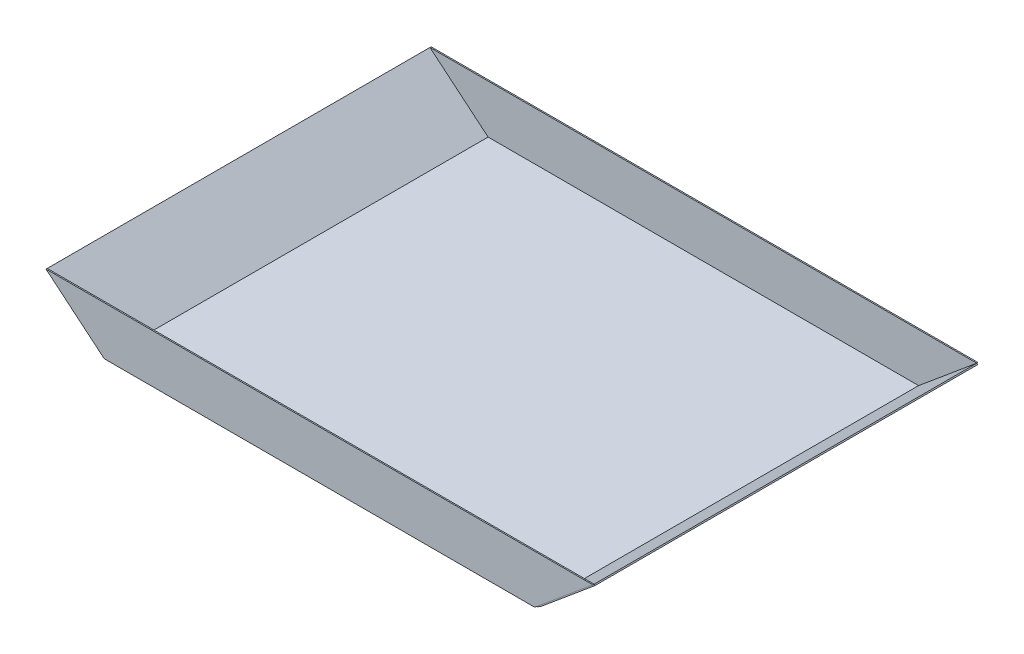
ISO-10303-21;
HEADER;
FILE_DESCRIPTION(('STEP AP214'),'2;1');
FILE_NAME('part.step','',(''),(''),'','','');
FILE_SCHEMA(('AUTOMOTIVE_DESIGN { 1 0 10303 214 1 1 1 1 }'));
ENDSEC;
DATA;
#1=APPLICATION_CONTEXT('core data for automotive mechanical design processes');
#2=APPLICATION_PROTOCOL_DEFINITION('international standard','automotive_design',2000,#1);
#3=PRODUCT_CONTEXT('',#1,'mechanical');
#4=PRODUCT('Part','Part','',(#3));
#5=PRODUCT_RELATED_PRODUCT_CATEGORY('part','',(#4));
#6=PRODUCT_DEFINITION_FORMATION('','',#4);
#7=PRODUCT_DEFINITION_CONTEXT('part definition',#1,'design');
#8=PRODUCT_DEFINITION('design','',#6,#7);
#9=PRODUCT_DEFINITION_SHAPE('','',#8);
#10=(LENGTH_UNIT() NAMED_UNIT(*) SI_UNIT(.MILLI.,.METRE.));
#11=(NAMED_UNIT(*) PLANE_ANGLE_UNIT() SI_UNIT($,.RADIAN.));
#12=(NAMED_UNIT(*) SI_UNIT($,.STERADIAN.) SOLID_ANGLE_UNIT());
#13=UNCERTAINTY_MEASURE_WITH_UNIT(LENGTH_MEASURE(1.E-05),#10,'distance_accuracy_value','');
#14=(GEOMETRIC_REPRESENTATION_CONTEXT(3) GLOBAL_UNCERTAINTY_ASSIGNED_CONTEXT((#13)) GLOBAL_UNIT_ASSIGNED_CONTEXT((#10,
#11,#12)) REPRESENTATION_CONTEXT('',''));
#15=CARTESIAN_POINT('',(0.,0.,0.));
#16=DIRECTION('',(0.,0.,1.));
#17=DIRECTION('',(1.,0.,0.));
#18=AXIS2_PLACEMENT_3D('',#15,#16,#17);
#19=CARTESIAN_POINT('',(564.261,0.,-1.5875));
#20=DIRECTION('',(-0.640243780505603,0.768171791674162,0.));
#21=DIRECTION('',(-0.768171791674162,-0.640243780505603,0.));
#22=AXIS2_PLACEMENT_3D('',#19,#20,#21);
#23=PLANE('',#22);
#24=DIRECTION('',(-0.768171791674163,-0.640243780505603,0.));
#25=VECTOR('',#24,1.);
#26=CARTESIAN_POINT('',(564.261,0.,0.));
#27=LINE('',#26,#25);
#28=CARTESIAN_POINT('',(640.551213318328,63.5851708171335,0.));
#29=VERTEX_POINT('',#28);
#30=CARTESIAN_POINT('',(564.261,0.,0.));
#31=VERTEX_POINT('',#30);
#32=EDGE_CURVE('E107',#29,#31,#27,.T.);
#33=ORIENTED_EDGE('',*,*,#32,.T.);
#34=DIRECTION('',(0.,0.,1.));
#35=VECTOR('',#34,1.);
#36=CARTESIAN_POINT('',(564.261,0.,-1.5875));
#37=LINE('',#36,#35);
#38=CARTESIAN_POINT('',(564.261,0.,-1.5875));
#39=VERTEX_POINT('',#38);
#40=EDGE_CURVE('E12',#39,#31,#37,.T.);
#41=ORIENTED_EDGE('',*,*,#40,.F.);
#42=DIRECTION('',(-0.768171791674163,-0.640243780505603,0.));
#43=VECTOR('',#42,1.);
#44=CARTESIAN_POINT('',(564.261,0.,-1.5875));
#45=LINE('',#44,#43);
#46=CARTESIAN_POINT('',(640.551213318328,63.5851708171335,-1.5875));
#47=VERTEX_POINT('',#46);
#48=EDGE_CURVE('E95',#47,#39,#45,.T.);
#49=ORIENTED_EDGE('',*,*,#48,.F.);
#50=DIRECTION('',(0.,0.,1.));
#51=VECTOR('',#50,1.);
#52=CARTESIAN_POINT('',(640.551213318328,63.5851708171335,-1.5875));
#53=LINE('',#52,#51);
#54=EDGE_CURVE('E103',#47,#29,#53,.T.);
#55=ORIENTED_EDGE('',*,*,#54,.T.);
#56=EDGE_LOOP('',(#33,#41,#49,#55));
#57=FACE_BOUND('',#56,.T.);
#58=ADVANCED_FACE('F44',(#57),#23,.F.);
#59=CARTESIAN_POINT('',(0.,0.,-1.5875));
#60=DIRECTION('',(0.,1.,0.));
#61=DIRECTION('',(0.,0.,1.));
#62=AXIS2_PLACEMENT_3D('',#59,#60,#61);
#63=PLANE('',#62);
#64=DIRECTION('',(-1.,0.,0.));
#65=VECTOR('',#64,1.);
#66=CARTESIAN_POINT('',(0.,0.,0.));
#67=LINE('',#66,#65);
#68=CARTESIAN_POINT('',(0.,0.,0.));
#69=VERTEX_POINT('',#68);
#70=EDGE_CURVE('E99',#31,#69,#67,.T.);
#71=ORIENTED_EDGE('',*,*,#70,.T.);
#72=DIRECTION('',(0.,0.,1.));
#73=VECTOR('',#72,1.);
#74=CARTESIAN_POINT('',(0.,0.,-1.5875));
#75=LINE('',#74,#73);
#76=CARTESIAN_POINT('',(0.,0.,-1.5875));
#77=VERTEX_POINT('',#76);
#78=EDGE_CURVE('E52',#77,#69,#75,.T.);
#79=ORIENTED_EDGE('',*,*,#78,.F.);
#80=DIRECTION('',(-1.,0.,0.));
#81=VECTOR('',#80,1.);
#82=CARTESIAN_POINT('',(0.,0.,-1.5875));
#83=LINE('',#82,#81);
#84=EDGE_CURVE('E90',#39,#77,#83,.T.);
#85=ORIENTED_EDGE('',*,*,#84,.F.);
#86=ORIENTED_EDGE('',*,*,#40,.T.);
#87=EDGE_LOOP('',(#71,#79,#85,#86));
#88=FACE_BOUND('',#87,.T.);
#89=ADVANCED_FACE('F98',(#88),#63,.F.);
#90=CARTESIAN_POINT('',(-76.2902133183278,63.5851708171335,-1.5875));
#91=DIRECTION('',(0.640243780505603,0.768171791674163,0.));
#92=DIRECTION('',(-0.768171791674163,0.640243780505603,0.));
#93=AXIS2_PLACEMENT_3D('',#90,#91,#92);
#94=PLANE('',#93);
#95=DIRECTION('',(-0.768171791674163,0.640243780505603,0.));
#96=VECTOR('',#95,1.);
#97=CARTESIAN_POINT('',(-76.2902133183278,63.5851708171335,0.));
#98=LINE('',#97,#96);
#99=CARTESIAN_POINT('',(-76.2902133183278,63.5851708171335,0.));
#100=VERTEX_POINT('',#99);
#101=EDGE_CURVE('E77',#69,#100,#98,.T.);
#102=ORIENTED_EDGE('',*,*,#101,.T.);
#103=DIRECTION('',(0.,0.,1.));
#104=VECTOR('',#103,1.);
#105=CARTESIAN_POINT('',(-76.2902133183278,63.5851708171335,-1.5875));
#106=LINE('',#105,#104);
#107=CARTESIAN_POINT('',(-76.2902133183278,63.5851708171335,-1.5875));
#108=VERTEX_POINT('',#107);
#109=EDGE_CURVE('E100',#108,#100,#106,.T.);
#110=ORIENTED_EDGE('',*,*,#109,.F.);
#111=DIRECTION('',(-0.768171791674163,0.640243780505603,0.));
#112=VECTOR('',#111,1.);
#113=CARTESIAN_POINT('',(-76.2902133183278,63.5851708171335,-1.5875));
#114=LINE('',#113,#112);
#115=EDGE_CURVE('E93',#77,#108,#114,.T.);
#116=ORIENTED_EDGE('',*,*,#115,.F.);
#117=ORIENTED_EDGE('',*,*,#78,.T.);
#118=EDGE_LOOP('',(#102,#110,#116,#117));
#119=FACE_BOUND('',#118,.T.);
#120=ADVANCED_FACE('F101',(#119),#94,.F.);
#121=CARTESIAN_POINT('',(640.551213318328,63.5851708171335,-1.5875));
#122=DIRECTION('',(0.,-1.,0.));
#123=DIRECTION('',(1.,0.,0.));
#124=AXIS2_PLACEMENT_3D('',#121,#122,#123);
#125=PLANE('',#124);
#126=DIRECTION('',(1.,0.,0.));
#127=VECTOR('',#126,1.);
#128=CARTESIAN_POINT('',(640.551213318328,63.5851708171335,0.));
#129=LINE('',#128,#127);
#130=EDGE_CURVE('E83',#100,#29,#129,.T.);
#131=ORIENTED_EDGE('',*,*,#130,.T.);
#132=ORIENTED_EDGE('',*,*,#54,.F.);
#133=DIRECTION('',(1.,0.,0.));
#134=VECTOR('',#133,1.);
#135=CARTESIAN_POINT('',(640.551213318328,63.5851708171335,-1.5875));
#136=LINE('',#135,#134);
#137=EDGE_CURVE('E60',#108,#47,#136,.T.);
#138=ORIENTED_EDGE('',*,*,#137,.F.);
#139=ORIENTED_EDGE('',*,*,#109,.T.);
#140=EDGE_LOOP('',(#131,#132,#138,#139));
#141=FACE_BOUND('',#140,.T.);
#142=ADVANCED_FACE('F114',(#141),#125,.F.);
#143=CARTESIAN_POINT('',(0.,0.,-1.5875));
#144=DIRECTION('',(0.,0.,-1.));
#145=DIRECTION('',(-1.,0.,0.));
#146=AXIS2_PLACEMENT_3D('',#143,#144,#145);
#147=PLANE('',#146);
#148=ORIENTED_EDGE('',*,*,#48,.T.);
#149=ORIENTED_EDGE('',*,*,#84,.T.);
#150=ORIENTED_EDGE('',*,*,#115,.T.);
#151=ORIENTED_EDGE('',*,*,#137,.T.);
#152=EDGE_LOOP('',(#148,#149,#150,#151));
#153=FACE_BOUND('',#152,.T.);
#154=ADVANCED_FACE('F91',(#153),#147,.T.);
#155=CARTESIAN_POINT('',(0.,0.,0.));
#156=DIRECTION('',(0.,0.,-1.));
#157=DIRECTION('',(-1.,0.,0.));
#158=AXIS2_PLACEMENT_3D('',#155,#156,#157);
#159=PLANE('',#158);
#160=ORIENTED_EDGE('',*,*,#32,.F.);
#161=ORIENTED_EDGE('',*,*,#130,.F.);
#162=ORIENTED_EDGE('',*,*,#101,.F.);
#163=ORIENTED_EDGE('',*,*,#70,.F.);
#164=EDGE_LOOP('',(#160,#161,#162,#163));
#165=FACE_BOUND('',#164,.T.);
#166=ADVANCED_FACE('F117',(#165),#159,.F.);
#167=CLOSED_SHELL('',(#58,#89,#120,#142,#154,#166));
#168=MANIFOLD_SOLID_BREP('B2',#167);
#169=CARTESIAN_POINT('',(0.,0.,503.2375));
#170=DIRECTION('',(0.640243780505603,0.768171791674163,0.));
#171=DIRECTION('',(-0.768171791674163,0.640243780505603,0.));
#172=AXIS2_PLACEMENT_3D('',#169,#170,#171);
#173=PLANE('',#172);
#174=DIRECTION('',(0.768171791674163,-0.640243780505603,0.));
#175=VECTOR('',#174,1.);
#176=CARTESIAN_POINT('',(0.,0.,501.65));
#177=LINE('',#176,#175);
#178=CARTESIAN_POINT('',(-76.2902133183278,63.5851708171335,501.65));
#179=VERTEX_POINT('',#178);
#180=CARTESIAN_POINT('',(0.,0.,501.65));
#181=VERTEX_POINT('',#180);
#182=EDGE_CURVE('E240',#179,#181,#177,.T.);
#183=ORIENTED_EDGE('',*,*,#182,.T.);
#184=DIRECTION('',(0.,0.,-1.));
#185=VECTOR('',#184,1.);
#186=CARTESIAN_POINT('',(0.,0.,503.2375));
#187=LINE('',#186,#185);
#188=CARTESIAN_POINT('',(0.,0.,503.2375));
#189=VERTEX_POINT('',#188);
#190=EDGE_CURVE('E42',#189,#181,#187,.T.);
#191=ORIENTED_EDGE('',*,*,#190,.F.);
#192=DIRECTION('',(0.768171791674163,-0.640243780505603,0.));
#193=VECTOR('',#192,1.);
#194=CARTESIAN_POINT('',(0.,0.,503.2375));
#195=LINE('',#194,#193);
#196=CARTESIAN_POINT('',(-76.2902133183278,63.5851708171335,503.2375));
#197=VERTEX_POINT('',#196);
#198=EDGE_CURVE('E228',#197,#189,#195,.T.);
#199=ORIENTED_EDGE('',*,*,#198,.F.);
#200=DIRECTION('',(0.,0.,-1.));
#201=VECTOR('',#200,1.);
#202=CARTESIAN_POINT('',(-76.2902133183278,63.5851708171335,503.2375));
#203=LINE('',#202,#201);
#204=EDGE_CURVE('E236',#197,#179,#203,.T.);
#205=ORIENTED_EDGE('',*,*,#204,.T.);
#206=EDGE_LOOP('',(#183,#191,#199,#205));
#207=FACE_BOUND('',#206,.T.);
#208=ADVANCED_FACE('F177',(#207),#173,.F.);
#209=CARTESIAN_POINT('',(564.261,0.,503.2375));
#210=DIRECTION('',(0.,1.,0.));
#211=DIRECTION('',(0.,0.,1.));
#212=AXIS2_PLACEMENT_3D('',#209,#210,#211);
#213=PLANE('',#212);
#214=DIRECTION('',(1.,0.,0.));
#215=VECTOR('',#214,1.);
#216=CARTESIAN_POINT('',(564.261,0.,501.65));
#217=LINE('',#216,#215);
#218=CARTESIAN_POINT('',(564.261,0.,501.65));
#219=VERTEX_POINT('',#218);
#220=EDGE_CURVE('E232',#181,#219,#217,.T.);
#221=ORIENTED_EDGE('',*,*,#220,.T.);
#222=DIRECTION('',(0.,0.,-1.));
#223=VECTOR('',#222,1.);
#224=CARTESIAN_POINT('',(564.261,0.,503.2375));
#225=LINE('',#224,#223);
#226=CARTESIAN_POINT('',(564.261,0.,503.2375));
#227=VERTEX_POINT('',#226);
#228=EDGE_CURVE('E185',#227,#219,#225,.T.);
#229=ORIENTED_EDGE('',*,*,#228,.F.);
#230=DIRECTION('',(1.,0.,0.));
#231=VECTOR('',#230,1.);
#232=CARTESIAN_POINT('',(564.261,0.,503.2375));
#233=LINE('',#232,#231);
#234=EDGE_CURVE('E223',#189,#227,#233,.T.);
#235=ORIENTED_EDGE('',*,*,#234,.F.);
#236=ORIENTED_EDGE('',*,*,#190,.T.);
#237=EDGE_LOOP('',(#221,#229,#235,#236));
#238=FACE_BOUND('',#237,.T.);
#239=ADVANCED_FACE('F231',(#238),#213,.F.);
#240=CARTESIAN_POINT('',(640.551213318328,63.5851708171335,503.2375));
#241=DIRECTION('',(-0.640243780505603,0.768171791674162,0.));
#242=DIRECTION('',(-0.768171791674162,-0.640243780505603,0.));
#243=AXIS2_PLACEMENT_3D('',#240,#241,#242);
#244=PLANE('',#243);
#245=DIRECTION('',(0.768171791674163,0.640243780505603,0.));
#246=VECTOR('',#245,1.);
#247=CARTESIAN_POINT('',(640.551213318328,63.5851708171335,501.65));
#248=LINE('',#247,#246);
#249=CARTESIAN_POINT('',(640.551213318328,63.5851708171335,501.65));
#250=VERTEX_POINT('',#249);
#251=EDGE_CURVE('E210',#219,#250,#248,.T.);
#252=ORIENTED_EDGE('',*,*,#251,.T.);
#253=DIRECTION('',(0.,0.,-1.));
#254=VECTOR('',#253,1.);
#255=CARTESIAN_POINT('',(640.551213318328,63.5851708171335,503.2375));
#256=LINE('',#255,#254);
#257=CARTESIAN_POINT('',(640.551213318328,63.5851708171335,503.2375));
#258=VERTEX_POINT('',#257);
#259=EDGE_CURVE('E233',#258,#250,#256,.T.);
#260=ORIENTED_EDGE('',*,*,#259,.F.);
#261=DIRECTION('',(0.768171791674163,0.640243780505603,0.));
#262=VECTOR('',#261,1.);
#263=CARTESIAN_POINT('',(640.551213318328,63.5851708171335,503.2375));
#264=LINE('',#263,#262);
#265=EDGE_CURVE('E226',#227,#258,#264,.T.);
#266=ORIENTED_EDGE('',*,*,#265,.F.);
#267=ORIENTED_EDGE('',*,*,#228,.T.);
#268=EDGE_LOOP('',(#252,#260,#266,#267));
#269=FACE_BOUND('',#268,.T.);
#270=ADVANCED_FACE('F234',(#269),#244,.F.);
#271=CARTESIAN_POINT('',(-76.2902133183278,63.5851708171335,503.2375));
#272=DIRECTION('',(0.,-1.,0.));
#273=DIRECTION('',(1.,0.,0.));
#274=AXIS2_PLACEMENT_3D('',#271,#272,#273);
#275=PLANE('',#274);
#276=DIRECTION('',(-1.,0.,0.));
#277=VECTOR('',#276,1.);
#278=CARTESIAN_POINT('',(-76.2902133183278,63.5851708171335,501.65));
#279=LINE('',#278,#277);
#280=EDGE_CURVE('E216',#250,#179,#279,.T.);
#281=ORIENTED_EDGE('',*,*,#280,.T.);
#282=ORIENTED_EDGE('',*,*,#204,.F.);
#283=DIRECTION('',(-1.,0.,0.));
#284=VECTOR('',#283,1.);
#285=CARTESIAN_POINT('',(-76.2902133183278,63.5851708171335,503.2375));
#286=LINE('',#285,#284);
#287=EDGE_CURVE('E193',#258,#197,#286,.T.);
#288=ORIENTED_EDGE('',*,*,#287,.F.);
#289=ORIENTED_EDGE('',*,*,#259,.T.);
#290=EDGE_LOOP('',(#281,#282,#288,#289));
#291=FACE_BOUND('',#290,.T.);
#292=ADVANCED_FACE('F247',(#291),#275,.F.);
#293=CARTESIAN_POINT('',(0.,0.,503.2375));
#294=DIRECTION('',(0.,0.,1.));
#295=DIRECTION('',(1.,0.,0.));
#296=AXIS2_PLACEMENT_3D('',#293,#294,#295);
#297=PLANE('',#296);
#298=ORIENTED_EDGE('',*,*,#198,.T.);
#299=ORIENTED_EDGE('',*,*,#234,.T.);
#300=ORIENTED_EDGE('',*,*,#265,.T.);
#301=ORIENTED_EDGE('',*,*,#287,.T.);
#302=EDGE_LOOP('',(#298,#299,#300,#301));
#303=FACE_BOUND('',#302,.T.);
#304=ADVANCED_FACE('F224',(#303),#297,.T.);
#305=CARTESIAN_POINT('',(0.,0.,501.65));
#306=DIRECTION('',(0.,0.,1.));
#307=DIRECTION('',(1.,0.,0.));
#308=AXIS2_PLACEMENT_3D('',#305,#306,#307);
#309=PLANE('',#308);
#310=ORIENTED_EDGE('',*,*,#182,.F.);
#311=ORIENTED_EDGE('',*,*,#280,.F.);
#312=ORIENTED_EDGE('',*,*,#251,.F.);
#313=ORIENTED_EDGE('',*,*,#220,.F.);
#314=EDGE_LOOP('',(#310,#311,#312,#313));
#315=FACE_BOUND('',#314,.T.);
#316=ADVANCED_FACE('F250',(#315),#309,.F.);
#317=CLOSED_SHELL('',(#208,#239,#270,#292,#304,#316));
#318=MANIFOLD_SOLID_BREP('B6',#317);
#319=CARTESIAN_POINT('',(565.277387001553,-1.21947271928273,501.65));
#320=DIRECTION('',(-0.640243780505603,0.768171791674162,0.));
#321=DIRECTION('',(-0.768171791674162,-0.640243780505603,0.));
#322=AXIS2_PLACEMENT_3D('',#319,#320,#321);
#323=PLANE('',#322);
#324=DIRECTION('',(0.768171791674162,0.640243780505603,0.));
#325=VECTOR('',#324,1.);
#326=CARTESIAN_POINT('',(565.277387001553,-1.21947271928273,501.65));
#327=LINE('',#326,#325);
#328=CARTESIAN_POINT('',(571.900836948781,4.30093649147628,501.65));
#329=VERTEX_POINT('',#328);
#330=CARTESIAN_POINT('',(641.56760031988,62.3656980978508,501.65));
#331=VERTEX_POINT('',#330);
#332=EDGE_CURVE('E379',#329,#331,#327,.T.);
#333=ORIENTED_EDGE('',*,*,#332,.F.);
#334=DIRECTION('',(0.,0.,-1.));
#335=VECTOR('',#334,1.);
#336=CARTESIAN_POINT('',(571.900836948781,4.30093649147627,501.65));
#337=LINE('',#336,#335);
#338=CARTESIAN_POINT('',(571.900836948781,4.30093649147628,0.));
#339=VERTEX_POINT('',#338);
#340=EDGE_CURVE('E175',#329,#339,#337,.T.);
#341=ORIENTED_EDGE('',*,*,#340,.T.);
#342=DIRECTION('',(0.768171791674162,0.640243780505603,0.));
#343=VECTOR('',#342,1.);
#344=CARTESIAN_POINT('',(565.277387001553,-1.21947271928273,0.));
#345=LINE('',#344,#343);
#346=CARTESIAN_POINT('',(641.56760031988,62.3656980978508,0.));
#347=VERTEX_POINT('',#346);
#348=EDGE_CURVE('E393',#339,#347,#345,.T.);
#349=ORIENTED_EDGE('',*,*,#348,.T.);
#350=DIRECTION('',(0.,0.,-1.));
#351=VECTOR('',#350,1.);
#352=CARTESIAN_POINT('',(641.56760031988,62.3656980978508,501.65));
#353=LINE('',#352,#351);
#354=EDGE_CURVE('E391',#331,#347,#353,.T.);
#355=ORIENTED_EDGE('',*,*,#354,.F.);
#356=EDGE_LOOP('',(#333,#341,#349,#355));
#357=FACE_BOUND('',#356,.T.);
#358=ADVANCED_FACE('F301',(#357),#323,.F.);
#359=CARTESIAN_POINT('',(640.551213318328,63.5851708171335,501.65));
#360=DIRECTION('',(0.768171791674172,0.640243780505591,0.));
#361=DIRECTION('',(-0.640243780505591,0.768171791674172,0.));
#362=AXIS2_PLACEMENT_3D('',#359,#360,#361);
#363=PLANE('',#362);
#364=DIRECTION('',(0.640243780505591,-0.768171791674172,0.));
#365=VECTOR('',#364,1.);
#366=CARTESIAN_POINT('',(640.551213318328,63.5851708171335,0.));
#367=LINE('',#366,#365);
#368=CARTESIAN_POINT('',(640.551213318328,63.5851708171335,0.));
#369=VERTEX_POINT('',#368);
#370=EDGE_CURVE('E420',#369,#347,#367,.T.);
#371=ORIENTED_EDGE('',*,*,#370,.F.);
#372=DIRECTION('',(0.,0.,-1.));
#373=VECTOR('',#372,1.);
#374=CARTESIAN_POINT('',(640.551213318328,63.5851708171335,501.65));
#375=LINE('',#374,#373);
#376=CARTESIAN_POINT('',(640.551213318328,63.5851708171335,501.65));
#377=VERTEX_POINT('',#376);
#378=EDGE_CURVE('E398',#377,#369,#375,.T.);
#379=ORIENTED_EDGE('',*,*,#378,.F.);
#380=DIRECTION('',(0.640243780505591,-0.768171791674172,0.));
#381=VECTOR('',#380,1.);
#382=CARTESIAN_POINT('',(640.551213318328,63.5851708171335,501.65));
#383=LINE('',#382,#381);
#384=EDGE_CURVE('E384',#377,#331,#383,.T.);
#385=ORIENTED_EDGE('',*,*,#384,.T.);
#386=ORIENTED_EDGE('',*,*,#354,.T.);
#387=EDGE_LOOP('',(#371,#379,#385,#386));
#388=FACE_BOUND('',#387,.T.);
#389=ADVANCED_FACE('F400',(#388),#363,.T.);
#390=CARTESIAN_POINT('',(564.261,0.,501.65));
#391=DIRECTION('',(-0.640243780505603,0.768171791674162,0.));
#392=DIRECTION('',(-0.768171791674162,-0.640243780505603,0.));
#393=AXIS2_PLACEMENT_3D('',#390,#391,#392);
#394=PLANE('',#393);
#395=DIRECTION('',(0.768171791674163,0.640243780505603,0.));
#396=VECTOR('',#395,1.);
#397=CARTESIAN_POINT('',(564.261,0.,0.));
#398=LINE('',#397,#396);
#399=CARTESIAN_POINT('',(564.261,0.,0.));
#400=VERTEX_POINT('',#399);
#401=EDGE_CURVE('E422',#400,#369,#398,.T.);
#402=ORIENTED_EDGE('',*,*,#401,.F.);
#403=DIRECTION('',(0.,0.,-1.));
#404=VECTOR('',#403,1.);
#405=CARTESIAN_POINT('',(564.261,0.,501.65));
#406=LINE('',#405,#404);
#407=CARTESIAN_POINT('',(564.261,0.,501.65));
#408=VERTEX_POINT('',#407);
#409=EDGE_CURVE('E443',#408,#400,#406,.T.);
#410=ORIENTED_EDGE('',*,*,#409,.F.);
#411=DIRECTION('',(0.768171791674163,0.640243780505603,0.));
#412=VECTOR('',#411,1.);
#413=CARTESIAN_POINT('',(564.261,0.,501.65));
#414=LINE('',#413,#412);
#415=EDGE_CURVE('E401',#408,#377,#414,.T.);
#416=ORIENTED_EDGE('',*,*,#415,.T.);
#417=ORIENTED_EDGE('',*,*,#378,.T.);
#418=EDGE_LOOP('',(#402,#410,#416,#417));
#419=FACE_BOUND('',#418,.T.);
#420=ADVANCED_FACE('F482',(#419),#394,.T.);
#421=CARTESIAN_POINT('',(0.,0.,501.65));
#422=DIRECTION('',(0.,1.,0.));
#423=DIRECTION('',(0.,0.,1.));
#424=AXIS2_PLACEMENT_3D('',#421,#422,#423);
#425=PLANE('',#424);
#426=DIRECTION('',(1.,0.,0.));
#427=VECTOR('',#426,1.);
#428=CARTESIAN_POINT('',(0.,0.,0.));
#429=LINE('',#428,#427);
#430=CARTESIAN_POINT('',(0.,0.,0.));
#431=VERTEX_POINT('',#430);
#432=EDGE_CURVE('E425',#431,#400,#429,.T.);
#433=ORIENTED_EDGE('',*,*,#432,.F.);
#434=DIRECTION('',(0.,0.,-1.));
#435=VECTOR('',#434,1.);
#436=CARTESIAN_POINT('',(0.,0.,501.65));
#437=LINE('',#436,#435);
#438=CARTESIAN_POINT('',(0.,0.,501.65));
#439=VERTEX_POINT('',#438);
#440=EDGE_CURVE('E441',#439,#431,#437,.T.);
#441=ORIENTED_EDGE('',*,*,#440,.F.);
#442=DIRECTION('',(1.,0.,0.));
#443=VECTOR('',#442,1.);
#444=CARTESIAN_POINT('',(0.,0.,501.65));
#445=LINE('',#444,#443);
#446=EDGE_CURVE('E403',#439,#408,#445,.T.);
#447=ORIENTED_EDGE('',*,*,#446,.T.);
#448=ORIENTED_EDGE('',*,*,#409,.T.);
#449=EDGE_LOOP('',(#433,#441,#447,#448));
#450=FACE_BOUND('',#449,.T.);
#451=ADVANCED_FACE('F479',(#450),#425,.T.);
#452=CARTESIAN_POINT('',(-76.2902133183278,63.5851708171335,501.65));
#453=DIRECTION('',(0.640243780505603,0.768171791674163,0.));
#454=DIRECTION('',(-0.768171791674163,0.640243780505603,0.));
#455=AXIS2_PLACEMENT_3D('',#452,#453,#454);
#456=PLANE('',#455);
#457=DIRECTION('',(0.768171791674163,-0.640243780505603,0.));
#458=VECTOR('',#457,1.);
#459=CARTESIAN_POINT('',(-76.2902133183278,63.5851708171335,0.));
#460=LINE('',#459,#458);
#461=CARTESIAN_POINT('',(-76.2902133183278,63.5851708171335,0.));
#462=VERTEX_POINT('',#461);
#463=EDGE_CURVE('E428',#462,#431,#460,.T.);
#464=ORIENTED_EDGE('',*,*,#463,.F.);
#465=DIRECTION('',(0.,0.,-1.));
#466=VECTOR('',#465,1.);
#467=CARTESIAN_POINT('',(-76.2902133183278,63.5851708171335,501.65));
#468=LINE('',#467,#466);
#469=CARTESIAN_POINT('',(-76.2902133183278,63.5851708171335,501.65));
#470=VERTEX_POINT('',#469);
#471=EDGE_CURVE('E439',#470,#462,#468,.T.);
#472=ORIENTED_EDGE('',*,*,#471,.F.);
#473=DIRECTION('',(0.768171791674163,-0.640243780505603,0.));
#474=VECTOR('',#473,1.);
#475=CARTESIAN_POINT('',(-76.2902133183278,63.5851708171335,501.65));
#476=LINE('',#475,#474);
#477=EDGE_CURVE('E408',#470,#439,#476,.T.);
#478=ORIENTED_EDGE('',*,*,#477,.T.);
#479=ORIENTED_EDGE('',*,*,#440,.T.);
#480=EDGE_LOOP('',(#464,#472,#478,#479));
#481=FACE_BOUND('',#480,.T.);
#482=ADVANCED_FACE('F475',(#481),#456,.T.);
#483=CARTESIAN_POINT('',(-77.3066003198804,62.3656980978507,501.65));
#484=DIRECTION('',(-0.768171791674163,0.640243780505602,0.));
#485=DIRECTION('',(-0.640243780505602,-0.768171791674163,0.));
#486=AXIS2_PLACEMENT_3D('',#483,#484,#485);
#487=PLANE('',#486);
#488=DIRECTION('',(0.640243780505602,0.768171791674163,0.));
#489=VECTOR('',#488,1.);
#490=CARTESIAN_POINT('',(-77.3066003198804,62.3656980978507,0.));
#491=LINE('',#490,#489);
#492=CARTESIAN_POINT('',(-77.3066003198804,62.3656980978507,0.));
#493=VERTEX_POINT('',#492);
#494=EDGE_CURVE('E431',#493,#462,#491,.T.);
#495=ORIENTED_EDGE('',*,*,#494,.F.);
#496=DIRECTION('',(0.,0.,-1.));
#497=VECTOR('',#496,1.);
#498=CARTESIAN_POINT('',(-77.3066003198804,62.3656980978507,501.65));
#499=LINE('',#498,#497);
#500=CARTESIAN_POINT('',(-77.3066003198804,62.3656980978507,501.65));
#501=VERTEX_POINT('',#500);
#502=EDGE_CURVE('E418',#501,#493,#499,.T.);
#503=ORIENTED_EDGE('',*,*,#502,.F.);
#504=DIRECTION('',(0.640243780505602,0.768171791674163,0.));
#505=VECTOR('',#504,1.);
#506=CARTESIAN_POINT('',(-77.3066003198804,62.3656980978507,501.65));
#507=LINE('',#506,#505);
#508=EDGE_CURVE('E411',#501,#470,#507,.T.);
#509=ORIENTED_EDGE('',*,*,#508,.T.);
#510=ORIENTED_EDGE('',*,*,#471,.T.);
#511=EDGE_LOOP('',(#495,#503,#509,#510));
#512=FACE_BOUND('',#511,.T.);
#513=ADVANCED_FACE('F471',(#512),#487,.T.);
#514=CARTESIAN_POINT('',(-77.3066003198804,62.3656980978507,501.65));
#515=DIRECTION('',(0.640243780505603,0.768171791674163,0.));
#516=DIRECTION('',(-0.768171791674163,0.640243780505603,0.));
#517=AXIS2_PLACEMENT_3D('',#514,#515,#516);
#518=PLANE('',#517);
#519=DIRECTION('',(0.768171791674163,-0.640243780505603,0.));
#520=VECTOR('',#519,1.);
#521=CARTESIAN_POINT('',(-77.3066003198804,62.3656980978507,0.));
#522=LINE('',#521,#520);
#523=CARTESIAN_POINT('',(-7.63983694878126,4.30093649147626,0.));
#524=VERTEX_POINT('',#523);
#525=EDGE_CURVE('E434',#493,#524,#522,.T.);
#526=ORIENTED_EDGE('',*,*,#525,.T.);
#527=DIRECTION('',(0.,0.,-1.));
#528=VECTOR('',#527,1.);
#529=CARTESIAN_POINT('',(-7.63983694878126,4.30093649147626,501.65));
#530=LINE('',#529,#528);
#531=CARTESIAN_POINT('',(-7.63983694878126,4.30093649147626,501.65));
#532=VERTEX_POINT('',#531);
#533=EDGE_CURVE('E324',#524,#532,#530,.F.);
#534=ORIENTED_EDGE('',*,*,#533,.T.);
#535=DIRECTION('',(0.768171791674163,-0.640243780505603,0.));
#536=VECTOR('',#535,1.);
#537=CARTESIAN_POINT('',(-77.3066003198804,62.3656980978507,501.65));
#538=LINE('',#537,#536);
#539=EDGE_CURVE('E414',#501,#532,#538,.T.);
#540=ORIENTED_EDGE('',*,*,#539,.F.);
#541=ORIENTED_EDGE('',*,*,#502,.T.);
#542=EDGE_LOOP('',(#526,#534,#540,#541));
#543=FACE_BOUND('',#542,.T.);
#544=ADVANCED_FACE('F469',(#543),#518,.F.);
#545=CARTESIAN_POINT('',(0.,-1.5875,501.65));
#546=DIRECTION('',(0.,1.,0.));
#547=DIRECTION('',(0.,0.,1.));
#548=AXIS2_PLACEMENT_3D('',#545,#546,#547);
#549=PLANE('',#548);
#550=DIRECTION('',(1.,0.,0.));
#551=VECTOR('',#550,1.);
#552=CARTESIAN_POINT('',(0.,-1.5875,501.65));
#553=LINE('',#552,#551);
#554=CARTESIAN_POINT('',(8.62235507606105,-1.5875,501.65));
#555=VERTEX_POINT('',#554);
#556=CARTESIAN_POINT('',(555.638644923939,-1.5875,501.65));
#557=VERTEX_POINT('',#556);
#558=EDGE_CURVE('E416',#555,#557,#553,.T.);
#559=ORIENTED_EDGE('',*,*,#558,.F.);
#560=DIRECTION('',(0.,0.,-1.));
#561=VECTOR('',#560,1.);
#562=CARTESIAN_POINT('',(8.62235507606105,-1.5875,501.65));
#563=LINE('',#562,#561);
#564=CARTESIAN_POINT('',(8.62235507606105,-1.5875,0.));
#565=VERTEX_POINT('',#564);
#566=EDGE_CURVE('E447',#555,#565,#563,.T.);
#567=ORIENTED_EDGE('',*,*,#566,.T.);
#568=DIRECTION('',(1.,0.,0.));
#569=VECTOR('',#568,1.);
#570=CARTESIAN_POINT('',(0.,-1.5875,0.));
#571=LINE('',#570,#569);
#572=CARTESIAN_POINT('',(555.638644923939,-1.5875,0.));
#573=VERTEX_POINT('',#572);
#574=EDGE_CURVE('E388',#565,#573,#571,.T.);
#575=ORIENTED_EDGE('',*,*,#574,.T.);
#576=DIRECTION('',(0.,0.,-1.));
#577=VECTOR('',#576,1.);
#578=CARTESIAN_POINT('',(555.638644923939,-1.5875,501.65));
#579=LINE('',#578,#577);
#580=EDGE_CURVE('E397',#573,#557,#579,.F.);
#581=ORIENTED_EDGE('',*,*,#580,.T.);
#582=EDGE_LOOP('',(#559,#567,#575,#581));
#583=FACE_BOUND('',#582,.T.);
#584=ADVANCED_FACE('F461',(#583),#549,.F.);
#585=CARTESIAN_POINT('',(0.,0.,501.65));
#586=DIRECTION('',(0.,0.,-1.));
#587=DIRECTION('',(-1.,0.,0.));
#588=AXIS2_PLACEMENT_3D('',#585,#586,#587);
#589=PLANE('',#588);
#590=ORIENTED_EDGE('',*,*,#539,.T.);
#591=CARTESIAN_POINT('',(8.62235507606105,23.8125,501.65));
#592=DIRECTION('',(0.,0.,-1.));
#593=DIRECTION('',(-1.,0.,0.));
#594=AXIS2_PLACEMENT_3D('',#591,#592,#593);
#595=CIRCLE('',#594,25.4);
#596=EDGE_CURVE('E309',#532,#555,#595,.F.);
#597=ORIENTED_EDGE('',*,*,#596,.T.);
#598=ORIENTED_EDGE('',*,*,#558,.T.);
#599=CARTESIAN_POINT('',(555.638644923939,23.8125,501.65));
#600=DIRECTION('',(0.,0.,-1.));
#601=DIRECTION('',(-1.,0.,0.));
#602=AXIS2_PLACEMENT_3D('',#599,#600,#601);
#603=CIRCLE('',#602,25.4);
#604=EDGE_CURVE('E316',#557,#329,#603,.F.);
#605=ORIENTED_EDGE('',*,*,#604,.T.);
#606=ORIENTED_EDGE('',*,*,#332,.T.);
#607=ORIENTED_EDGE('',*,*,#384,.F.);
#608=ORIENTED_EDGE('',*,*,#415,.F.);
#609=ORIENTED_EDGE('',*,*,#446,.F.);
#610=ORIENTED_EDGE('',*,*,#477,.F.);
#611=ORIENTED_EDGE('',*,*,#508,.F.);
#612=EDGE_LOOP('',(#590,#597,#598,#605,#606,#607,#608,#609,#610,#611));
#613=FACE_BOUND('',#612,.T.);
#614=ADVANCED_FACE('F381',(#613),#589,.F.);
#615=CARTESIAN_POINT('',(0.,0.,0.));
#616=DIRECTION('',(0.,0.,-1.));
#617=DIRECTION('',(-1.,0.,0.));
#618=AXIS2_PLACEMENT_3D('',#615,#616,#617);
#619=PLANE('',#618);
#620=ORIENTED_EDGE('',*,*,#574,.F.);
#621=CARTESIAN_POINT('',(8.62235507606105,23.8125,0.));
#622=DIRECTION('',(0.,0.,-1.));
#623=DIRECTION('',(-1.,0.,0.));
#624=AXIS2_PLACEMENT_3D('',#621,#622,#623);
#625=CIRCLE('',#624,25.4);
#626=EDGE_CURVE('E452',#565,#524,#625,.T.);
#627=ORIENTED_EDGE('',*,*,#626,.T.);
#628=ORIENTED_EDGE('',*,*,#525,.F.);
#629=ORIENTED_EDGE('',*,*,#494,.T.);
#630=ORIENTED_EDGE('',*,*,#463,.T.);
#631=ORIENTED_EDGE('',*,*,#432,.T.);
#632=ORIENTED_EDGE('',*,*,#401,.T.);
#633=ORIENTED_EDGE('',*,*,#370,.T.);
#634=ORIENTED_EDGE('',*,*,#348,.F.);
#635=CARTESIAN_POINT('',(555.638644923939,23.8125,0.));
#636=DIRECTION('',(0.,0.,-1.));
#637=DIRECTION('',(-1.,0.,0.));
#638=AXIS2_PLACEMENT_3D('',#635,#636,#637);
#639=CIRCLE('',#638,25.4);
#640=EDGE_CURVE('E450',#339,#573,#639,.T.);
#641=ORIENTED_EDGE('',*,*,#640,.T.);
#642=EDGE_LOOP('',(#620,#627,#628,#629,#630,#631,#632,#633,#634,#641));
#643=FACE_BOUND('',#642,.T.);
#644=ADVANCED_FACE('F467',(#643),#619,.T.);
#645=CARTESIAN_POINT('',(8.62235507606105,23.8125,501.65));
#646=DIRECTION('',(0.,0.,-1.));
#647=DIRECTION('',(-1.,0.,0.));
#648=AXIS2_PLACEMENT_3D('',#645,#646,#647);
#649=CYLINDRICAL_SURFACE('',#648,25.4);
#650=ORIENTED_EDGE('',*,*,#596,.F.);
#651=ORIENTED_EDGE('',*,*,#533,.F.);
#652=ORIENTED_EDGE('',*,*,#626,.F.);
#653=ORIENTED_EDGE('',*,*,#566,.F.);
#654=EDGE_LOOP('',(#650,#651,#652,#653));
#655=FACE_BOUND('',#654,.T.);
#656=ADVANCED_FACE('F464',(#655),#649,.T.);
#657=CARTESIAN_POINT('',(555.638644923939,23.8125,501.65));
#658=DIRECTION('',(0.,0.,-1.));
#659=DIRECTION('',(-1.,0.,0.));
#660=AXIS2_PLACEMENT_3D('',#657,#658,#659);
#661=CYLINDRICAL_SURFACE('',#660,25.4);
#662=ORIENTED_EDGE('',*,*,#604,.F.);
#663=ORIENTED_EDGE('',*,*,#580,.F.);
#664=ORIENTED_EDGE('',*,*,#640,.F.);
#665=ORIENTED_EDGE('',*,*,#340,.F.);
#666=EDGE_LOOP('',(#662,#663,#664,#665));
#667=FACE_BOUND('',#666,.T.);
#668=ADVANCED_FACE('F303',(#667),#661,.T.);
#669=CLOSED_SHELL('',(#358,#389,#420,#451,#482,#513,#544,#584,#614,#644,#656,#668));
#670=MANIFOLD_SOLID_BREP('B36',#669);
#671=ADVANCED_BREP_SHAPE_REPRESENTATION('',(#18,#168,#318,#670),#14);
#672=SHAPE_DEFINITION_REPRESENTATION(#9,#671);
ENDSEC;
END-ISO-10303-21;
